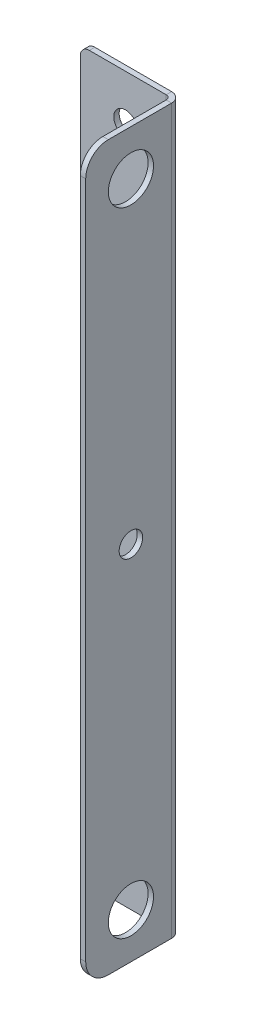
ISO-10303-21;
HEADER;
FILE_DESCRIPTION(('STEP AP214'),'2;1');
FILE_NAME('part.step','',(''),(''),'','','');
FILE_SCHEMA(('AUTOMOTIVE_DESIGN { 1 0 10303 214 1 1 1 1 }'));
ENDSEC;
DATA;
#1=APPLICATION_CONTEXT('core data for automotive mechanical design processes');
#2=APPLICATION_PROTOCOL_DEFINITION('international standard','automotive_design',2000,#1);
#3=PRODUCT_CONTEXT('',#1,'mechanical');
#4=PRODUCT('Part','Part','',(#3));
#5=PRODUCT_RELATED_PRODUCT_CATEGORY('part','',(#4));
#6=PRODUCT_DEFINITION_FORMATION('','',#4);
#7=PRODUCT_DEFINITION_CONTEXT('part definition',#1,'design');
#8=PRODUCT_DEFINITION('design','',#6,#7);
#9=PRODUCT_DEFINITION_SHAPE('','',#8);
#10=(LENGTH_UNIT() NAMED_UNIT(*) SI_UNIT(.MILLI.,.METRE.));
#11=(NAMED_UNIT(*) PLANE_ANGLE_UNIT() SI_UNIT($,.RADIAN.));
#12=(NAMED_UNIT(*) SI_UNIT($,.STERADIAN.) SOLID_ANGLE_UNIT());
#13=UNCERTAINTY_MEASURE_WITH_UNIT(LENGTH_MEASURE(1.E-05),#10,'distance_accuracy_value','');
#14=(GEOMETRIC_REPRESENTATION_CONTEXT(3) GLOBAL_UNCERTAINTY_ASSIGNED_CONTEXT((#13)) GLOBAL_UNIT_ASSIGNED_CONTEXT((#10,
#11,#12)) REPRESENTATION_CONTEXT('',''));
#15=CARTESIAN_POINT('',(0.,0.,0.));
#16=DIRECTION('',(0.,0.,1.));
#17=DIRECTION('',(1.,0.,0.));
#18=AXIS2_PLACEMENT_3D('',#15,#16,#17);
#19=CARTESIAN_POINT('',(-7.99999999999995,-80.,-1.2));
#20=DIRECTION('',(0.,-1.,0.));
#21=DIRECTION('',(0.,0.,-1.));
#22=AXIS2_PLACEMENT_3D('',#19,#20,#21);
#23=PLANE('',#22);
#24=DIRECTION('',(1.,0.,0.));
#25=VECTOR('',#24,1.);
#26=CARTESIAN_POINT('',(-7.99999999999995,-80.,0.));
#27=LINE('',#26,#25);
#28=CARTESIAN_POINT('',(-7.99999999999995,-80.,0.));
#29=VERTEX_POINT('',#28);
#30=CARTESIAN_POINT('',(9.00000000000004,-80.,0.));
#31=VERTEX_POINT('',#30);
#32=EDGE_CURVE('E172',#29,#31,#27,.T.);
#33=ORIENTED_EDGE('',*,*,#32,.F.);
#34=DIRECTION('',(0.,0.,1.));
#35=VECTOR('',#34,1.);
#36=CARTESIAN_POINT('',(-7.99999999999995,-80.,-1.2));
#37=LINE('',#36,#35);
#38=CARTESIAN_POINT('',(-7.99999999999995,-80.,-1.2));
#39=VERTEX_POINT('',#38);
#40=EDGE_CURVE('E82',#39,#29,#37,.T.);
#41=ORIENTED_EDGE('',*,*,#40,.F.);
#42=DIRECTION('',(1.,0.,0.));
#43=VECTOR('',#42,1.);
#44=CARTESIAN_POINT('',(-7.99999999999995,-80.,-1.2));
#45=LINE('',#44,#43);
#46=CARTESIAN_POINT('',(9.00000000000004,-80.,-1.2));
#47=VERTEX_POINT('',#46);
#48=EDGE_CURVE('E149',#39,#47,#45,.T.);
#49=ORIENTED_EDGE('',*,*,#48,.T.);
#50=DIRECTION('',(0.,0.,1.));
#51=VECTOR('',#50,1.);
#52=CARTESIAN_POINT('',(9.00000000000004,-80.,-1.2));
#53=LINE('',#52,#51);
#54=EDGE_CURVE('E13',#47,#31,#53,.T.);
#55=ORIENTED_EDGE('',*,*,#54,.T.);
#56=EDGE_LOOP('',(#33,#41,#49,#55));
#57=FACE_BOUND('',#56,.T.);
#58=ADVANCED_FACE('F72',(#57),#23,.T.);
#59=CARTESIAN_POINT('',(-7.99999999999997,-78.,-1.2));
#60=DIRECTION('',(0.,0.,1.));
#61=DIRECTION('',(1.,0.,0.));
#62=AXIS2_PLACEMENT_3D('',#59,#60,#61);
#63=CYLINDRICAL_SURFACE('',#62,2.);
#64=CARTESIAN_POINT('',(-7.99999999999997,-78.,0.));
#65=DIRECTION('',(0.,0.,1.));
#66=DIRECTION('',(1.,0.,0.));
#67=AXIS2_PLACEMENT_3D('',#64,#65,#66);
#68=CIRCLE('',#67,2.);
#69=CARTESIAN_POINT('',(-9.99999999999997,-78.,0.));
#70=VERTEX_POINT('',#69);
#71=EDGE_CURVE('E139',#70,#29,#68,.T.);
#72=ORIENTED_EDGE('',*,*,#71,.F.);
#73=DIRECTION('',(0.,0.,1.));
#74=VECTOR('',#73,1.);
#75=CARTESIAN_POINT('',(-9.99999999999997,-78.,-1.2));
#76=LINE('',#75,#74);
#77=CARTESIAN_POINT('',(-9.99999999999997,-78.,-1.2));
#78=VERTEX_POINT('',#77);
#79=EDGE_CURVE('E135',#78,#70,#76,.T.);
#80=ORIENTED_EDGE('',*,*,#79,.F.);
#81=CARTESIAN_POINT('',(-7.99999999999997,-78.,-1.2));
#82=DIRECTION('',(0.,0.,1.));
#83=DIRECTION('',(1.,0.,0.));
#84=AXIS2_PLACEMENT_3D('',#81,#82,#83);
#85=CIRCLE('',#84,2.);
#86=EDGE_CURVE('E138',#78,#39,#85,.T.);
#87=ORIENTED_EDGE('',*,*,#86,.T.);
#88=ORIENTED_EDGE('',*,*,#40,.T.);
#89=EDGE_LOOP('',(#72,#80,#87,#88));
#90=FACE_BOUND('',#89,.T.);
#91=ADVANCED_FACE('F137',(#90),#63,.T.);
#92=CARTESIAN_POINT('',(-9.99999999999997,78.,-1.2));
#93=DIRECTION('',(-1.,0.,0.));
#94=DIRECTION('',(0.,0.,1.));
#95=AXIS2_PLACEMENT_3D('',#92,#93,#94);
#96=PLANE('',#95);
#97=DIRECTION('',(0.,-1.,0.));
#98=VECTOR('',#97,1.);
#99=CARTESIAN_POINT('',(-9.99999999999997,78.,0.));
#100=LINE('',#99,#98);
#101=CARTESIAN_POINT('',(-9.99999999999997,78.,0.));
#102=VERTEX_POINT('',#101);
#103=EDGE_CURVE('E169',#102,#70,#100,.T.);
#104=ORIENTED_EDGE('',*,*,#103,.F.);
#105=DIRECTION('',(0.,0.,1.));
#106=VECTOR('',#105,1.);
#107=CARTESIAN_POINT('',(-9.99999999999997,78.,-1.2));
#108=LINE('',#107,#106);
#109=CARTESIAN_POINT('',(-9.99999999999997,78.,-1.2));
#110=VERTEX_POINT('',#109);
#111=EDGE_CURVE('E144',#110,#102,#108,.T.);
#112=ORIENTED_EDGE('',*,*,#111,.F.);
#113=DIRECTION('',(0.,-1.,0.));
#114=VECTOR('',#113,1.);
#115=CARTESIAN_POINT('',(-9.99999999999997,78.,-1.2));
#116=LINE('',#115,#114);
#117=EDGE_CURVE('E148',#110,#78,#116,.T.);
#118=ORIENTED_EDGE('',*,*,#117,.T.);
#119=ORIENTED_EDGE('',*,*,#79,.T.);
#120=EDGE_LOOP('',(#104,#112,#118,#119));
#121=FACE_BOUND('',#120,.T.);
#122=ADVANCED_FACE('F151',(#121),#96,.T.);
#123=CARTESIAN_POINT('',(-7.99999999999997,78.,-1.2));
#124=DIRECTION('',(0.,0.,1.));
#125=DIRECTION('',(1.,0.,0.));
#126=AXIS2_PLACEMENT_3D('',#123,#124,#125);
#127=CYLINDRICAL_SURFACE('',#126,2.);
#128=CARTESIAN_POINT('',(-7.99999999999997,78.,0.));
#129=DIRECTION('',(0.,0.,1.));
#130=DIRECTION('',(1.,0.,0.));
#131=AXIS2_PLACEMENT_3D('',#128,#129,#130);
#132=CIRCLE('',#131,2.);
#133=CARTESIAN_POINT('',(-7.99999999999995,80.,0.));
#134=VERTEX_POINT('',#133);
#135=EDGE_CURVE('E166',#134,#102,#132,.T.);
#136=ORIENTED_EDGE('',*,*,#135,.F.);
#137=DIRECTION('',(0.,0.,1.));
#138=VECTOR('',#137,1.);
#139=CARTESIAN_POINT('',(-7.99999999999995,80.,-1.2));
#140=LINE('',#139,#138);
#141=CARTESIAN_POINT('',(-7.99999999999995,80.,-1.2));
#142=VERTEX_POINT('',#141);
#143=EDGE_CURVE('E127',#142,#134,#140,.T.);
#144=ORIENTED_EDGE('',*,*,#143,.F.);
#145=CARTESIAN_POINT('',(-7.99999999999997,78.,-1.2));
#146=DIRECTION('',(0.,0.,1.));
#147=DIRECTION('',(1.,0.,0.));
#148=AXIS2_PLACEMENT_3D('',#145,#146,#147);
#149=CIRCLE('',#148,2.);
#150=EDGE_CURVE('E152',#142,#110,#149,.T.);
#151=ORIENTED_EDGE('',*,*,#150,.T.);
#152=ORIENTED_EDGE('',*,*,#111,.T.);
#153=EDGE_LOOP('',(#136,#144,#151,#152));
#154=FACE_BOUND('',#153,.T.);
#155=ADVANCED_FACE('F361',(#154),#127,.T.);
#156=CARTESIAN_POINT('',(-7.99999999999995,80.,-1.2));
#157=DIRECTION('',(0.,1.,0.));
#158=DIRECTION('',(0.,0.,1.));
#159=AXIS2_PLACEMENT_3D('',#156,#157,#158);
#160=PLANE('',#159);
#161=DIRECTION('',(-1.,0.,0.));
#162=VECTOR('',#161,1.);
#163=CARTESIAN_POINT('',(-7.99999999999995,80.,0.));
#164=LINE('',#163,#162);
#165=CARTESIAN_POINT('',(9.00000000000003,80.,0.));
#166=VERTEX_POINT('',#165);
#167=EDGE_CURVE('E162',#166,#134,#164,.T.);
#168=ORIENTED_EDGE('',*,*,#167,.F.);
#169=DIRECTION('',(0.,0.,1.));
#170=VECTOR('',#169,1.);
#171=CARTESIAN_POINT('',(9.00000000000003,80.,-1.2));
#172=LINE('',#171,#170);
#173=CARTESIAN_POINT('',(9.00000000000002,80.,-1.20000000000001));
#174=VERTEX_POINT('',#173);
#175=EDGE_CURVE('E76',#174,#166,#172,.T.);
#176=ORIENTED_EDGE('',*,*,#175,.F.);
#177=DIRECTION('',(-1.,0.,0.));
#178=VECTOR('',#177,1.);
#179=CARTESIAN_POINT('',(-7.99999999999995,80.,-1.2));
#180=LINE('',#179,#178);
#181=EDGE_CURVE('E154',#174,#142,#180,.T.);
#182=ORIENTED_EDGE('',*,*,#181,.T.);
#183=ORIENTED_EDGE('',*,*,#143,.T.);
#184=EDGE_LOOP('',(#168,#176,#182,#183));
#185=FACE_BOUND('',#184,.T.);
#186=ADVANCED_FACE('F74',(#185),#160,.T.);
#187=CARTESIAN_POINT('',(-7.99999999999997,-78.,-1.2));
#188=DIRECTION('',(0.,0.,1.));
#189=DIRECTION('',(1.,0.,0.));
#190=AXIS2_PLACEMENT_3D('',#187,#188,#189);
#191=PLANE('',#190);
#192=CARTESIAN_POINT('',(0.,70.,-1.2));
#193=DIRECTION('',(0.,0.,1.));
#194=DIRECTION('',(1.,0.,0.));
#195=AXIS2_PLACEMENT_3D('',#192,#193,#194);
#196=CIRCLE('',#195,2.6);
#197=CARTESIAN_POINT('',(2.6,70.,-1.2));
#198=VERTEX_POINT('',#197);
#199=EDGE_CURVE('E206',#198,#198,#196,.T.);
#200=ORIENTED_EDGE('',*,*,#199,.T.);
#201=EDGE_LOOP('',(#200));
#202=FACE_BOUND('',#201,.T.);
#203=CARTESIAN_POINT('',(0.,-70.,-1.2));
#204=DIRECTION('',(0.,0.,1.));
#205=DIRECTION('',(1.,0.,0.));
#206=AXIS2_PLACEMENT_3D('',#203,#204,#205);
#207=CIRCLE('',#206,2.6);
#208=CARTESIAN_POINT('',(2.6,-70.,-1.2));
#209=VERTEX_POINT('',#208);
#210=EDGE_CURVE('E163',#209,#209,#207,.T.);
#211=ORIENTED_EDGE('',*,*,#210,.T.);
#212=EDGE_LOOP('',(#211));
#213=FACE_BOUND('',#212,.T.);
#214=DIRECTION('',(0.,1.,0.));
#215=VECTOR('',#214,1.);
#216=CARTESIAN_POINT('',(9.00000000000003,80.,-1.2));
#217=LINE('',#216,#215);
#218=EDGE_CURVE('E91',#47,#174,#217,.T.);
#219=ORIENTED_EDGE('',*,*,#218,.F.);
#220=ORIENTED_EDGE('',*,*,#48,.F.);
#221=ORIENTED_EDGE('',*,*,#86,.F.);
#222=ORIENTED_EDGE('',*,*,#117,.F.);
#223=ORIENTED_EDGE('',*,*,#150,.F.);
#224=ORIENTED_EDGE('',*,*,#181,.F.);
#225=EDGE_LOOP('',(#219,#220,#221,#222,#223,#224));
#226=FACE_BOUND('',#225,.T.);
#227=ADVANCED_FACE('F147',(#202,#213,#226),#191,.F.);
#228=CARTESIAN_POINT('',(-7.99999999999997,-78.,0.));
#229=DIRECTION('',(0.,0.,1.));
#230=DIRECTION('',(1.,0.,0.));
#231=AXIS2_PLACEMENT_3D('',#228,#229,#230);
#232=PLANE('',#231);
#233=CARTESIAN_POINT('',(0.,70.,0.));
#234=DIRECTION('',(0.,0.,1.));
#235=DIRECTION('',(1.,0.,0.));
#236=AXIS2_PLACEMENT_3D('',#233,#234,#235);
#237=CIRCLE('',#236,2.6);
#238=CARTESIAN_POINT('',(2.6,70.,0.));
#239=VERTEX_POINT('',#238);
#240=EDGE_CURVE('E210',#239,#239,#237,.T.);
#241=ORIENTED_EDGE('',*,*,#240,.F.);
#242=EDGE_LOOP('',(#241));
#243=FACE_BOUND('',#242,.T.);
#244=CARTESIAN_POINT('',(0.,-70.,0.));
#245=DIRECTION('',(0.,0.,1.));
#246=DIRECTION('',(1.,0.,0.));
#247=AXIS2_PLACEMENT_3D('',#244,#245,#246);
#248=CIRCLE('',#247,2.6);
#249=CARTESIAN_POINT('',(2.6,-70.,0.));
#250=VERTEX_POINT('',#249);
#251=EDGE_CURVE('E209',#250,#250,#248,.T.);
#252=ORIENTED_EDGE('',*,*,#251,.F.);
#253=EDGE_LOOP('',(#252));
#254=FACE_BOUND('',#253,.T.);
#255=DIRECTION('',(0.,1.,0.));
#256=VECTOR('',#255,1.);
#257=CARTESIAN_POINT('',(9.00000000000003,80.,0.));
#258=LINE('',#257,#256);
#259=EDGE_CURVE('E159',#31,#166,#258,.T.);
#260=ORIENTED_EDGE('',*,*,#259,.T.);
#261=ORIENTED_EDGE('',*,*,#167,.T.);
#262=ORIENTED_EDGE('',*,*,#135,.T.);
#263=ORIENTED_EDGE('',*,*,#103,.T.);
#264=ORIENTED_EDGE('',*,*,#71,.T.);
#265=ORIENTED_EDGE('',*,*,#32,.T.);
#266=EDGE_LOOP('',(#260,#261,#262,#263,#264,#265));
#267=FACE_BOUND('',#266,.T.);
#268=ADVANCED_FACE('F357',(#243,#254,#267),#232,.T.);
#269=CARTESIAN_POINT('',(0.,-70.,-1.2));
#270=DIRECTION('',(0.,0.,1.));
#271=DIRECTION('',(1.,0.,0.));
#272=AXIS2_PLACEMENT_3D('',#269,#270,#271);
#273=CYLINDRICAL_SURFACE('',#272,2.6);
#274=ORIENTED_EDGE('',*,*,#210,.F.);
#275=EDGE_LOOP('',(#274));
#276=FACE_BOUND('',#275,.T.);
#277=ORIENTED_EDGE('',*,*,#251,.T.);
#278=EDGE_LOOP('',(#277));
#279=FACE_BOUND('',#278,.T.);
#280=ADVANCED_FACE('F368',(#276,#279),#273,.F.);
#281=CARTESIAN_POINT('',(0.,70.,-1.2));
#282=DIRECTION('',(0.,0.,1.));
#283=DIRECTION('',(1.,0.,0.));
#284=AXIS2_PLACEMENT_3D('',#281,#282,#283);
#285=CYLINDRICAL_SURFACE('',#284,2.6);
#286=ORIENTED_EDGE('',*,*,#199,.F.);
#287=EDGE_LOOP('',(#286));
#288=FACE_BOUND('',#287,.T.);
#289=ORIENTED_EDGE('',*,*,#240,.T.);
#290=EDGE_LOOP('',(#289));
#291=FACE_BOUND('',#290,.T.);
#292=ADVANCED_FACE('F374',(#288,#291),#285,.F.);
#293=CARTESIAN_POINT('',(9.00000000000004,-80.,0.999999999999997));
#294=DIRECTION('',(0.,-1.,0.));
#295=DIRECTION('',(0.,0.,-1.));
#296=AXIS2_PLACEMENT_3D('',#293,#294,#295);
#297=PLANE('',#296);
#298=DIRECTION('',(-1.,0.,0.));
#299=VECTOR('',#298,1.);
#300=CARTESIAN_POINT('',(11.2,-80.,0.999999999999994));
#301=LINE('',#300,#299);
#302=CARTESIAN_POINT('',(10.,-80.,0.999999999999994));
#303=VERTEX_POINT('',#302);
#304=CARTESIAN_POINT('',(11.2,-80.,0.99999999999999));
#305=VERTEX_POINT('',#304);
#306=EDGE_CURVE('E229',#303,#305,#301,.F.);
#307=ORIENTED_EDGE('',*,*,#306,.F.);
#308=CARTESIAN_POINT('',(9.00000000000004,-80.,0.999999999999997));
#309=DIRECTION('',(0.,1.,0.));
#310=DIRECTION('',(0.,0.,1.));
#311=AXIS2_PLACEMENT_3D('',#308,#309,#310);
#312=CIRCLE('',#311,1.00000000000001);
#313=EDGE_CURVE('E197',#31,#303,#312,.F.);
#314=ORIENTED_EDGE('',*,*,#313,.F.);
#315=ORIENTED_EDGE('',*,*,#54,.F.);
#316=CARTESIAN_POINT('',(9.00000000000004,-80.,0.999999999999997));
#317=DIRECTION('',(0.,1.,0.));
#318=DIRECTION('',(0.,0.,1.));
#319=AXIS2_PLACEMENT_3D('',#316,#317,#318);
#320=CIRCLE('',#319,2.20000000000001);
#321=EDGE_CURVE('E213',#47,#305,#320,.F.);
#322=ORIENTED_EDGE('',*,*,#321,.T.);
#323=EDGE_LOOP('',(#307,#314,#315,#322));
#324=FACE_BOUND('',#323,.T.);
#325=ADVANCED_FACE('F317',(#324),#297,.T.);
#326=CARTESIAN_POINT('',(9.00000000000004,80.,0.999999999999997));
#327=DIRECTION('',(0.,-1.,0.));
#328=DIRECTION('',(0.,0.,-1.));
#329=AXIS2_PLACEMENT_3D('',#326,#327,#328);
#330=PLANE('',#329);
#331=CARTESIAN_POINT('',(9.00000000000004,80.,0.999999999999997));
#332=DIRECTION('',(0.,1.,0.));
#333=DIRECTION('',(0.,0.,1.));
#334=AXIS2_PLACEMENT_3D('',#331,#332,#333);
#335=CIRCLE('',#334,1.00000000000001);
#336=CARTESIAN_POINT('',(10.,80.,0.999999999999994));
#337=VERTEX_POINT('',#336);
#338=EDGE_CURVE('E185',#337,#166,#335,.T.);
#339=ORIENTED_EDGE('',*,*,#338,.F.);
#340=DIRECTION('',(-1.,0.,0.));
#341=VECTOR('',#340,1.);
#342=CARTESIAN_POINT('',(10.,80.,0.99999999999999));
#343=LINE('',#342,#341);
#344=CARTESIAN_POINT('',(11.2,80.,0.999999999999987));
#345=VERTEX_POINT('',#344);
#346=EDGE_CURVE('E262',#337,#345,#343,.F.);
#347=ORIENTED_EDGE('',*,*,#346,.T.);
#348=CARTESIAN_POINT('',(9.00000000000004,80.,0.999999999999997));
#349=DIRECTION('',(0.,1.,0.));
#350=DIRECTION('',(0.,0.,1.));
#351=AXIS2_PLACEMENT_3D('',#348,#349,#350);
#352=CIRCLE('',#351,2.20000000000001);
#353=EDGE_CURVE('E188',#345,#174,#352,.T.);
#354=ORIENTED_EDGE('',*,*,#353,.T.);
#355=ORIENTED_EDGE('',*,*,#175,.T.);
#356=EDGE_LOOP('',(#339,#347,#354,#355));
#357=FACE_BOUND('',#356,.T.);
#358=ADVANCED_FACE('F183',(#357),#330,.F.);
#359=CARTESIAN_POINT('',(9.00000000000004,80.,0.999999999999997));
#360=DIRECTION('',(0.,1.,0.));
#361=DIRECTION('',(1.,0.,0.));
#362=AXIS2_PLACEMENT_3D('',#359,#360,#361);
#363=CYLINDRICAL_SURFACE('',#362,2.20000000000001);
#364=ORIENTED_EDGE('',*,*,#218,.T.);
#365=ORIENTED_EDGE('',*,*,#353,.F.);
#366=DIRECTION('',(0.,1.,0.));
#367=VECTOR('',#366,1.);
#368=CARTESIAN_POINT('',(11.2,-80.,0.999999999999993));
#369=LINE('',#368,#367);
#370=EDGE_CURVE('E311',#345,#305,#369,.F.);
#371=ORIENTED_EDGE('',*,*,#370,.T.);
#372=ORIENTED_EDGE('',*,*,#321,.F.);
#373=EDGE_LOOP('',(#364,#365,#371,#372));
#374=FACE_BOUND('',#373,.T.);
#375=ADVANCED_FACE('F393',(#374),#363,.T.);
#376=CARTESIAN_POINT('',(9.00000000000004,80.,0.999999999999997));
#377=DIRECTION('',(0.,1.,0.));
#378=DIRECTION('',(1.,0.,0.));
#379=AXIS2_PLACEMENT_3D('',#376,#377,#378);
#380=CYLINDRICAL_SURFACE('',#379,1.00000000000001);
#381=ORIENTED_EDGE('',*,*,#259,.F.);
#382=ORIENTED_EDGE('',*,*,#313,.T.);
#383=DIRECTION('',(0.,1.,0.));
#384=VECTOR('',#383,1.);
#385=CARTESIAN_POINT('',(10.,-80.,0.999999999999997));
#386=LINE('',#385,#384);
#387=EDGE_CURVE('E196',#303,#337,#386,.T.);
#388=ORIENTED_EDGE('',*,*,#387,.T.);
#389=ORIENTED_EDGE('',*,*,#338,.T.);
#390=EDGE_LOOP('',(#381,#382,#388,#389));
#391=FACE_BOUND('',#390,.T.);
#392=ADVANCED_FACE('F192',(#391),#380,.F.);
#393=CARTESIAN_POINT('',(11.2000000000001,75.,15.));
#394=DIRECTION('',(-1.,0.,0.));
#395=DIRECTION('',(0.,0.,1.));
#396=AXIS2_PLACEMENT_3D('',#393,#394,#395);
#397=PLANE('',#396);
#398=CARTESIAN_POINT('',(11.2000000000001,-70.,9.99999999999992));
#399=DIRECTION('',(-1.,0.,0.));
#400=DIRECTION('',(0.,0.,1.));
#401=AXIS2_PLACEMENT_3D('',#398,#399,#400);
#402=CIRCLE('',#401,5.);
#403=CARTESIAN_POINT('',(11.2000000000001,-70.,14.9999999999999));
#404=VERTEX_POINT('',#403);
#405=EDGE_CURVE('E305',#404,#404,#402,.F.);
#406=ORIENTED_EDGE('',*,*,#405,.F.);
#407=EDGE_LOOP('',(#406));
#408=FACE_BOUND('',#407,.T.);
#409=CARTESIAN_POINT('',(11.2000000000001,70.,9.99999999999992));
#410=DIRECTION('',(-1.,0.,0.));
#411=DIRECTION('',(0.,0.,1.));
#412=AXIS2_PLACEMENT_3D('',#409,#410,#411);
#413=CIRCLE('',#412,5.);
#414=CARTESIAN_POINT('',(11.2000000000001,70.,14.9999999999999));
#415=VERTEX_POINT('',#414);
#416=EDGE_CURVE('E299',#415,#415,#413,.F.);
#417=ORIENTED_EDGE('',*,*,#416,.F.);
#418=EDGE_LOOP('',(#417));
#419=FACE_BOUND('',#418,.T.);
#420=CARTESIAN_POINT('',(11.2000000000001,0.,9.99999999999994));
#421=DIRECTION('',(-1.,0.,0.));
#422=DIRECTION('',(0.,0.,1.));
#423=AXIS2_PLACEMENT_3D('',#420,#421,#422);
#424=CIRCLE('',#423,2.6);
#425=CARTESIAN_POINT('',(11.2000000000001,0.,12.5999999999999));
#426=VERTEX_POINT('',#425);
#427=EDGE_CURVE('E265',#426,#426,#424,.F.);
#428=ORIENTED_EDGE('',*,*,#427,.F.);
#429=EDGE_LOOP('',(#428));
#430=FACE_BOUND('',#429,.T.);
#431=ORIENTED_EDGE('',*,*,#370,.F.);
#432=DIRECTION('',(0.,0.,1.));
#433=VECTOR('',#432,1.);
#434=CARTESIAN_POINT('',(11.2000000000001,80.,15.));
#435=LINE('',#434,#433);
#436=CARTESIAN_POINT('',(11.2000000000001,80.,15.));
#437=VERTEX_POINT('',#436);
#438=EDGE_CURVE('E281',#345,#437,#435,.T.);
#439=ORIENTED_EDGE('',*,*,#438,.T.);
#440=CARTESIAN_POINT('',(11.2000000000001,75.,15.));
#441=DIRECTION('',(-1.,0.,0.));
#442=DIRECTION('',(0.,0.,1.));
#443=AXIS2_PLACEMENT_3D('',#440,#441,#442);
#444=CIRCLE('',#443,5.);
#445=CARTESIAN_POINT('',(11.2000000000001,75.,20.));
#446=VERTEX_POINT('',#445);
#447=EDGE_CURVE('E277',#437,#446,#444,.F.);
#448=ORIENTED_EDGE('',*,*,#447,.T.);
#449=DIRECTION('',(0.,-1.,0.));
#450=VECTOR('',#449,1.);
#451=CARTESIAN_POINT('',(11.2000000000001,75.,20.));
#452=LINE('',#451,#450);
#453=CARTESIAN_POINT('',(11.2000000000001,-75.,20.));
#454=VERTEX_POINT('',#453);
#455=EDGE_CURVE('E280',#446,#454,#452,.T.);
#456=ORIENTED_EDGE('',*,*,#455,.T.);
#457=CARTESIAN_POINT('',(11.2000000000001,-75.,15.));
#458=DIRECTION('',(-1.,0.,0.));
#459=DIRECTION('',(0.,0.,1.));
#460=AXIS2_PLACEMENT_3D('',#457,#458,#459);
#461=CIRCLE('',#460,5.);
#462=CARTESIAN_POINT('',(11.2000000000001,-80.,15.));
#463=VERTEX_POINT('',#462);
#464=EDGE_CURVE('E283',#454,#463,#461,.F.);
#465=ORIENTED_EDGE('',*,*,#464,.T.);
#466=DIRECTION('',(0.,0.,-1.));
#467=VECTOR('',#466,1.);
#468=CARTESIAN_POINT('',(11.2000000000001,-80.,15.));
#469=LINE('',#468,#467);
#470=EDGE_CURVE('E323',#463,#305,#469,.T.);
#471=ORIENTED_EDGE('',*,*,#470,.T.);
#472=EDGE_LOOP('',(#431,#439,#448,#456,#465,#471));
#473=FACE_BOUND('',#472,.T.);
#474=ADVANCED_FACE('F326',(#408,#419,#430,#473),#397,.F.);
#475=CARTESIAN_POINT('',(10.0000000000001,75.,15.));
#476=DIRECTION('',(-1.,0.,0.));
#477=DIRECTION('',(0.,0.,1.));
#478=AXIS2_PLACEMENT_3D('',#475,#476,#477);
#479=PLANE('',#478);
#480=CARTESIAN_POINT('',(10.0000000000001,70.,9.99999999999992));
#481=DIRECTION('',(-1.,0.,0.));
#482=DIRECTION('',(0.,0.,1.));
#483=AXIS2_PLACEMENT_3D('',#480,#481,#482);
#484=CIRCLE('',#483,5.);
#485=CARTESIAN_POINT('',(10.0000000000001,70.,14.9999999999999));
#486=VERTEX_POINT('',#485);
#487=EDGE_CURVE('E302',#486,#486,#484,.F.);
#488=ORIENTED_EDGE('',*,*,#487,.T.);
#489=EDGE_LOOP('',(#488));
#490=FACE_BOUND('',#489,.T.);
#491=CARTESIAN_POINT('',(10.0000000000001,0.,9.99999999999995));
#492=DIRECTION('',(-1.,0.,0.));
#493=DIRECTION('',(0.,0.,1.));
#494=AXIS2_PLACEMENT_3D('',#491,#492,#493);
#495=CIRCLE('',#494,2.6);
#496=CARTESIAN_POINT('',(10.0000000000001,0.,12.5999999999999));
#497=VERTEX_POINT('',#496);
#498=EDGE_CURVE('E296',#497,#497,#495,.F.);
#499=ORIENTED_EDGE('',*,*,#498,.T.);
#500=EDGE_LOOP('',(#499));
#501=FACE_BOUND('',#500,.T.);
#502=CARTESIAN_POINT('',(10.0000000000001,-70.,9.99999999999992));
#503=DIRECTION('',(-1.,0.,0.));
#504=DIRECTION('',(0.,0.,1.));
#505=AXIS2_PLACEMENT_3D('',#502,#503,#504);
#506=CIRCLE('',#505,5.);
#507=CARTESIAN_POINT('',(10.0000000000001,-70.,14.9999999999999));
#508=VERTEX_POINT('',#507);
#509=EDGE_CURVE('E308',#508,#508,#506,.F.);
#510=ORIENTED_EDGE('',*,*,#509,.T.);
#511=EDGE_LOOP('',(#510));
#512=FACE_BOUND('',#511,.T.);
#513=DIRECTION('',(0.,0.,-1.));
#514=VECTOR('',#513,1.);
#515=CARTESIAN_POINT('',(10.,80.,0.));
#516=LINE('',#515,#514);
#517=CARTESIAN_POINT('',(10.0000000000001,80.,15.));
#518=VERTEX_POINT('',#517);
#519=EDGE_CURVE('E258',#337,#518,#516,.F.);
#520=ORIENTED_EDGE('',*,*,#519,.F.);
#521=ORIENTED_EDGE('',*,*,#387,.F.);
#522=DIRECTION('',(0.,0.,1.));
#523=VECTOR('',#522,1.);
#524=CARTESIAN_POINT('',(10.0000000000001,-80.,15.));
#525=LINE('',#524,#523);
#526=CARTESIAN_POINT('',(10.0000000000001,-80.,15.));
#527=VERTEX_POINT('',#526);
#528=EDGE_CURVE('E285',#527,#303,#525,.F.);
#529=ORIENTED_EDGE('',*,*,#528,.F.);
#530=CARTESIAN_POINT('',(10.0000000000001,-75.,15.));
#531=DIRECTION('',(-1.,0.,0.));
#532=DIRECTION('',(0.,0.,1.));
#533=AXIS2_PLACEMENT_3D('',#530,#531,#532);
#534=CIRCLE('',#533,5.);
#535=CARTESIAN_POINT('',(10.0000000000001,-75.,20.));
#536=VERTEX_POINT('',#535);
#537=EDGE_CURVE('E291',#536,#527,#534,.F.);
#538=ORIENTED_EDGE('',*,*,#537,.F.);
#539=DIRECTION('',(0.,1.,0.));
#540=VECTOR('',#539,1.);
#541=CARTESIAN_POINT('',(10.0000000000001,75.,20.));
#542=LINE('',#541,#540);
#543=CARTESIAN_POINT('',(10.0000000000001,75.,20.));
#544=VERTEX_POINT('',#543);
#545=EDGE_CURVE('E270',#544,#536,#542,.F.);
#546=ORIENTED_EDGE('',*,*,#545,.F.);
#547=CARTESIAN_POINT('',(10.0000000000001,75.,15.));
#548=DIRECTION('',(-1.,0.,0.));
#549=DIRECTION('',(0.,0.,1.));
#550=AXIS2_PLACEMENT_3D('',#547,#548,#549);
#551=CIRCLE('',#550,5.);
#552=EDGE_CURVE('E264',#518,#544,#551,.F.);
#553=ORIENTED_EDGE('',*,*,#552,.F.);
#554=EDGE_LOOP('',(#520,#521,#529,#538,#546,#553));
#555=FACE_BOUND('',#554,.T.);
#556=ADVANCED_FACE('F268',(#490,#501,#512,#555),#479,.T.);
#557=CARTESIAN_POINT('',(11.2,80.,0.));
#558=DIRECTION('',(0.,-1.,0.));
#559=DIRECTION('',(1.,0.,0.));
#560=AXIS2_PLACEMENT_3D('',#557,#558,#559);
#561=PLANE('',#560);
#562=ORIENTED_EDGE('',*,*,#346,.F.);
#563=ORIENTED_EDGE('',*,*,#519,.T.);
#564=DIRECTION('',(-1.,0.,0.));
#565=VECTOR('',#564,1.);
#566=CARTESIAN_POINT('',(11.2000000000001,80.,15.));
#567=LINE('',#566,#565);
#568=EDGE_CURVE('E198',#437,#518,#567,.T.);
#569=ORIENTED_EDGE('',*,*,#568,.F.);
#570=ORIENTED_EDGE('',*,*,#438,.F.);
#571=EDGE_LOOP('',(#562,#563,#569,#570));
#572=FACE_BOUND('',#571,.T.);
#573=ADVANCED_FACE('F260',(#572),#561,.F.);
#574=CARTESIAN_POINT('',(11.2000000000001,-80.,15.));
#575=DIRECTION('',(0.,1.,0.));
#576=DIRECTION('',(-1.,0.,0.));
#577=AXIS2_PLACEMENT_3D('',#574,#575,#576);
#578=PLANE('',#577);
#579=ORIENTED_EDGE('',*,*,#306,.T.);
#580=ORIENTED_EDGE('',*,*,#470,.F.);
#581=DIRECTION('',(-1.,0.,0.));
#582=VECTOR('',#581,1.);
#583=CARTESIAN_POINT('',(11.2000000000001,-80.,15.));
#584=LINE('',#583,#582);
#585=EDGE_CURVE('E329',#463,#527,#584,.T.);
#586=ORIENTED_EDGE('',*,*,#585,.T.);
#587=ORIENTED_EDGE('',*,*,#528,.T.);
#588=EDGE_LOOP('',(#579,#580,#586,#587));
#589=FACE_BOUND('',#588,.T.);
#590=ADVANCED_FACE('F321',(#589),#578,.F.);
#591=CARTESIAN_POINT('',(11.2000000000001,75.,15.));
#592=DIRECTION('',(-1.,0.,0.));
#593=DIRECTION('',(0.,0.,1.));
#594=AXIS2_PLACEMENT_3D('',#591,#592,#593);
#595=CYLINDRICAL_SURFACE('',#594,5.);
#596=ORIENTED_EDGE('',*,*,#552,.T.);
#597=DIRECTION('',(-1.,0.,0.));
#598=VECTOR('',#597,1.);
#599=CARTESIAN_POINT('',(11.2000000000001,75.,20.));
#600=LINE('',#599,#598);
#601=EDGE_CURVE('E202',#446,#544,#600,.T.);
#602=ORIENTED_EDGE('',*,*,#601,.F.);
#603=ORIENTED_EDGE('',*,*,#447,.F.);
#604=ORIENTED_EDGE('',*,*,#568,.T.);
#605=EDGE_LOOP('',(#596,#602,#603,#604));
#606=FACE_BOUND('',#605,.T.);
#607=ADVANCED_FACE('F276',(#606),#595,.T.);
#608=CARTESIAN_POINT('',(11.2000000000001,75.,20.));
#609=DIRECTION('',(0.,0.,-1.));
#610=DIRECTION('',(-1.,0.,0.));
#611=AXIS2_PLACEMENT_3D('',#608,#609,#610);
#612=PLANE('',#611);
#613=ORIENTED_EDGE('',*,*,#545,.T.);
#614=DIRECTION('',(-1.,0.,0.));
#615=VECTOR('',#614,1.);
#616=CARTESIAN_POINT('',(11.2000000000001,-75.,20.));
#617=LINE('',#616,#615);
#618=EDGE_CURVE('E331',#454,#536,#617,.T.);
#619=ORIENTED_EDGE('',*,*,#618,.F.);
#620=ORIENTED_EDGE('',*,*,#455,.F.);
#621=ORIENTED_EDGE('',*,*,#601,.T.);
#622=EDGE_LOOP('',(#613,#619,#620,#621));
#623=FACE_BOUND('',#622,.T.);
#624=ADVANCED_FACE('F340',(#623),#612,.F.);
#625=CARTESIAN_POINT('',(11.2000000000001,-75.,15.));
#626=DIRECTION('',(-1.,0.,0.));
#627=DIRECTION('',(0.,0.,1.));
#628=AXIS2_PLACEMENT_3D('',#625,#626,#627);
#629=CYLINDRICAL_SURFACE('',#628,5.);
#630=ORIENTED_EDGE('',*,*,#537,.T.);
#631=ORIENTED_EDGE('',*,*,#585,.F.);
#632=ORIENTED_EDGE('',*,*,#464,.F.);
#633=ORIENTED_EDGE('',*,*,#618,.T.);
#634=EDGE_LOOP('',(#630,#631,#632,#633));
#635=FACE_BOUND('',#634,.T.);
#636=ADVANCED_FACE('F338',(#635),#629,.T.);
#637=CARTESIAN_POINT('',(11.2000000000001,0.,9.99999999999994));
#638=DIRECTION('',(-1.,0.,0.));
#639=DIRECTION('',(0.,0.,1.));
#640=AXIS2_PLACEMENT_3D('',#637,#638,#639);
#641=CYLINDRICAL_SURFACE('',#640,2.6);
#642=ORIENTED_EDGE('',*,*,#427,.T.);
#643=EDGE_LOOP('',(#642));
#644=FACE_BOUND('',#643,.T.);
#645=ORIENTED_EDGE('',*,*,#498,.F.);
#646=EDGE_LOOP('',(#645));
#647=FACE_BOUND('',#646,.T.);
#648=ADVANCED_FACE('F347',(#644,#647),#641,.F.);
#649=CARTESIAN_POINT('',(11.2000000000001,70.,9.99999999999992));
#650=DIRECTION('',(-1.,0.,0.));
#651=DIRECTION('',(0.,0.,1.));
#652=AXIS2_PLACEMENT_3D('',#649,#650,#651);
#653=CYLINDRICAL_SURFACE('',#652,5.);
#654=ORIENTED_EDGE('',*,*,#416,.T.);
#655=EDGE_LOOP('',(#654));
#656=FACE_BOUND('',#655,.T.);
#657=ORIENTED_EDGE('',*,*,#487,.F.);
#658=EDGE_LOOP('',(#657));
#659=FACE_BOUND('',#658,.T.);
#660=ADVANCED_FACE('F416',(#656,#659),#653,.F.);
#661=CARTESIAN_POINT('',(11.2000000000001,-70.,9.99999999999992));
#662=DIRECTION('',(-1.,0.,0.));
#663=DIRECTION('',(0.,0.,1.));
#664=AXIS2_PLACEMENT_3D('',#661,#662,#663);
#665=CYLINDRICAL_SURFACE('',#664,5.);
#666=ORIENTED_EDGE('',*,*,#405,.T.);
#667=EDGE_LOOP('',(#666));
#668=FACE_BOUND('',#667,.T.);
#669=ORIENTED_EDGE('',*,*,#509,.F.);
#670=EDGE_LOOP('',(#669));
#671=FACE_BOUND('',#670,.T.);
#672=ADVANCED_FACE('F420',(#668,#671),#665,.F.);
#673=CLOSED_SHELL('',(#58,#91,#122,#155,#186,#227,#268,#280,#292,#325,#358,#375,#392,#474,#556,
#573,#590,#607,#624,#636,#648,#660,#672));
#674=MANIFOLD_SOLID_BREP('B2',#673);
#675=ADVANCED_BREP_SHAPE_REPRESENTATION('',(#18,#674),#14);
#676=SHAPE_DEFINITION_REPRESENTATION(#9,#675);
ENDSEC;
END-ISO-10303-21;
